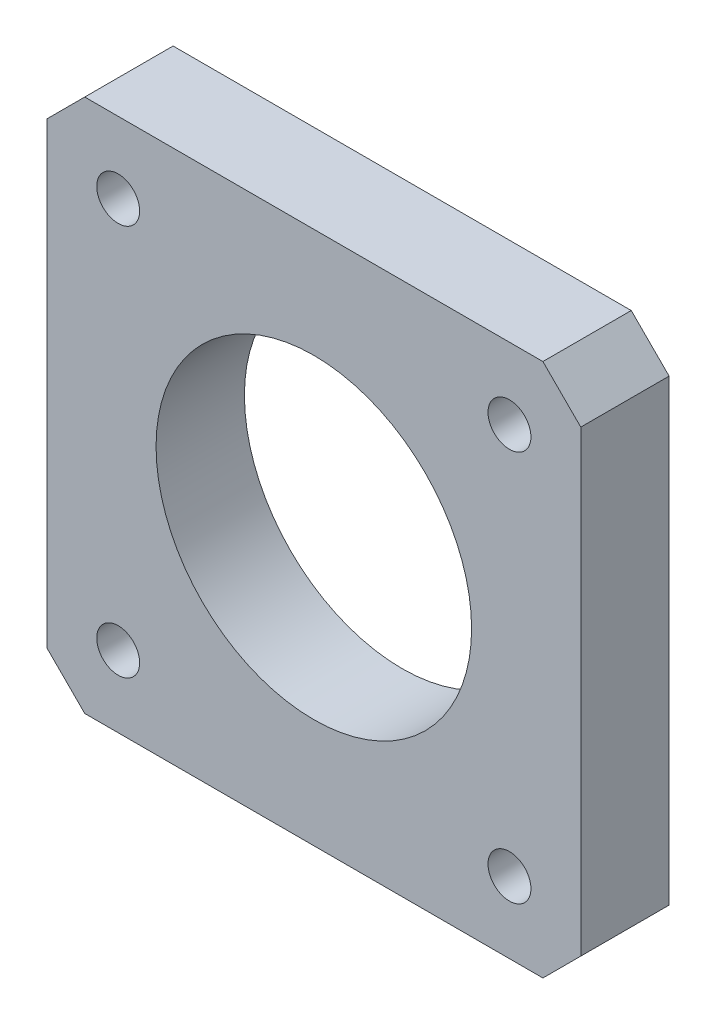
ISO-10303-21;
HEADER;
FILE_DESCRIPTION(('STEP AP214'),'2;1');
FILE_NAME('part.step','',(''),(''),'','','');
FILE_SCHEMA(('AUTOMOTIVE_DESIGN { 1 0 10303 214 1 1 1 1 }'));
ENDSEC;
DATA;
#1=APPLICATION_CONTEXT('core data for automotive mechanical design processes');
#2=APPLICATION_PROTOCOL_DEFINITION('international standard','automotive_design',2000,#1);
#3=PRODUCT_CONTEXT('',#1,'mechanical');
#4=PRODUCT('Part','Part','',(#3));
#5=PRODUCT_RELATED_PRODUCT_CATEGORY('part','',(#4));
#6=PRODUCT_DEFINITION_FORMATION('','',#4);
#7=PRODUCT_DEFINITION_CONTEXT('part definition',#1,'design');
#8=PRODUCT_DEFINITION('design','',#6,#7);
#9=PRODUCT_DEFINITION_SHAPE('','',#8);
#10=(LENGTH_UNIT() NAMED_UNIT(*) SI_UNIT(.MILLI.,.METRE.));
#11=(NAMED_UNIT(*) PLANE_ANGLE_UNIT() SI_UNIT($,.RADIAN.));
#12=(NAMED_UNIT(*) SI_UNIT($,.STERADIAN.) SOLID_ANGLE_UNIT());
#13=UNCERTAINTY_MEASURE_WITH_UNIT(LENGTH_MEASURE(1.E-05),#10,'distance_accuracy_value','');
#14=(GEOMETRIC_REPRESENTATION_CONTEXT(3) GLOBAL_UNCERTAINTY_ASSIGNED_CONTEXT((#13)) GLOBAL_UNIT_ASSIGNED_CONTEXT((#10,
#11,#12)) REPRESENTATION_CONTEXT('',''));
#15=CARTESIAN_POINT('',(0.,0.,0.));
#16=DIRECTION('',(0.,0.,1.));
#17=DIRECTION('',(1.,0.,0.));
#18=AXIS2_PLACEMENT_3D('',#15,#16,#17);
#19=CARTESIAN_POINT('',(0.,0.,7.));
#20=DIRECTION('',(0.,0.,-1.));
#21=DIRECTION('',(-1.,0.,0.));
#22=AXIS2_PLACEMENT_3D('',#19,#20,#21);
#23=PLANE('',#22);
#24=CARTESIAN_POINT('',(15.5,15.5,7.));
#25=DIRECTION('',(0.,0.,1.));
#26=DIRECTION('',(1.,0.,0.));
#27=AXIS2_PLACEMENT_3D('',#24,#25,#26);
#28=CIRCLE('',#27,1.7);
#29=CARTESIAN_POINT('',(17.2,15.5,7.));
#30=VERTEX_POINT('',#29);
#31=EDGE_CURVE('E247',#30,#30,#28,.T.);
#32=ORIENTED_EDGE('',*,*,#31,.F.);
#33=EDGE_LOOP('',(#32));
#34=FACE_BOUND('',#33,.T.);
#35=CARTESIAN_POINT('',(-15.5,15.4999999999998,7.));
#36=DIRECTION('',(0.,0.,1.));
#37=DIRECTION('',(1.,0.,0.));
#38=AXIS2_PLACEMENT_3D('',#35,#36,#37);
#39=CIRCLE('',#38,1.7);
#40=CARTESIAN_POINT('',(-13.8,15.4999999999998,7.));
#41=VERTEX_POINT('',#40);
#42=EDGE_CURVE('E172',#41,#41,#39,.T.);
#43=ORIENTED_EDGE('',*,*,#42,.F.);
#44=EDGE_LOOP('',(#43));
#45=FACE_BOUND('',#44,.T.);
#46=CARTESIAN_POINT('',(-15.4999999999997,-15.5000000000002,7.));
#47=DIRECTION('',(0.,0.,1.));
#48=DIRECTION('',(1.,0.,0.));
#49=AXIS2_PLACEMENT_3D('',#46,#47,#48);
#50=CIRCLE('',#49,1.7);
#51=CARTESIAN_POINT('',(-13.7999999999997,-15.5000000000002,7.));
#52=VERTEX_POINT('',#51);
#53=EDGE_CURVE('E161',#52,#52,#50,.T.);
#54=ORIENTED_EDGE('',*,*,#53,.F.);
#55=EDGE_LOOP('',(#54));
#56=FACE_BOUND('',#55,.T.);
#57=CARTESIAN_POINT('',(15.5000000000003,-15.5,7.));
#58=DIRECTION('',(0.,0.,1.));
#59=DIRECTION('',(1.,0.,0.));
#60=AXIS2_PLACEMENT_3D('',#57,#58,#59);
#61=CIRCLE('',#60,1.7);
#62=CARTESIAN_POINT('',(17.2000000000003,-15.5,7.));
#63=VERTEX_POINT('',#62);
#64=EDGE_CURVE('E160',#63,#63,#61,.T.);
#65=ORIENTED_EDGE('',*,*,#64,.F.);
#66=EDGE_LOOP('',(#65));
#67=FACE_BOUND('',#66,.T.);
#68=DIRECTION('',(0.,-1.,0.));
#69=VECTOR('',#68,1.);
#70=CARTESIAN_POINT('',(-21.15,-21.15,7.));
#71=LINE('',#70,#69);
#72=CARTESIAN_POINT('',(-21.15,18.15,7.));
#73=VERTEX_POINT('',#72);
#74=CARTESIAN_POINT('',(-21.15,-18.15,7.));
#75=VERTEX_POINT('',#74);
#76=EDGE_CURVE('E186',#73,#75,#71,.T.);
#77=ORIENTED_EDGE('',*,*,#76,.T.);
#78=DIRECTION('',(-0.707106781186547,0.707106781186548,0.));
#79=VECTOR('',#78,1.);
#80=CARTESIAN_POINT('',(-18.15,-21.15,7.));
#81=LINE('',#80,#79);
#82=CARTESIAN_POINT('',(-18.15,-21.15,7.));
#83=VERTEX_POINT('',#82);
#84=EDGE_CURVE('E150',#75,#83,#81,.F.);
#85=ORIENTED_EDGE('',*,*,#84,.T.);
#86=DIRECTION('',(1.,0.,0.));
#87=VECTOR('',#86,1.);
#88=CARTESIAN_POINT('',(-21.15,-21.15,7.));
#89=LINE('',#88,#87);
#90=CARTESIAN_POINT('',(18.15,-21.15,7.));
#91=VERTEX_POINT('',#90);
#92=EDGE_CURVE('E121',#83,#91,#89,.T.);
#93=ORIENTED_EDGE('',*,*,#92,.T.);
#94=DIRECTION('',(-0.707106781186549,-0.707106781186546,0.));
#95=VECTOR('',#94,1.);
#96=CARTESIAN_POINT('',(21.15,-18.15,7.));
#97=LINE('',#96,#95);
#98=CARTESIAN_POINT('',(21.15,-18.15,7.));
#99=VERTEX_POINT('',#98);
#100=EDGE_CURVE('E148',#91,#99,#97,.F.);
#101=ORIENTED_EDGE('',*,*,#100,.T.);
#102=DIRECTION('',(0.,1.,0.));
#103=VECTOR('',#102,1.);
#104=CARTESIAN_POINT('',(21.15,-21.15,7.));
#105=LINE('',#104,#103);
#106=CARTESIAN_POINT('',(21.15,18.15,7.));
#107=VERTEX_POINT('',#106);
#108=EDGE_CURVE('E128',#99,#107,#105,.T.);
#109=ORIENTED_EDGE('',*,*,#108,.T.);
#110=DIRECTION('',(0.707106781186546,-0.707106781186549,0.));
#111=VECTOR('',#110,1.);
#112=CARTESIAN_POINT('',(18.15,21.15,7.));
#113=LINE('',#112,#111);
#114=CARTESIAN_POINT('',(18.15,21.15,7.));
#115=VERTEX_POINT('',#114);
#116=EDGE_CURVE('E56',#107,#115,#113,.F.);
#117=ORIENTED_EDGE('',*,*,#116,.T.);
#118=DIRECTION('',(-1.,0.,0.));
#119=VECTOR('',#118,1.);
#120=CARTESIAN_POINT('',(-21.15,21.15,7.));
#121=LINE('',#120,#119);
#122=CARTESIAN_POINT('',(-18.15,21.15,7.));
#123=VERTEX_POINT('',#122);
#124=EDGE_CURVE('E131',#115,#123,#121,.T.);
#125=ORIENTED_EDGE('',*,*,#124,.T.);
#126=DIRECTION('',(0.707106781186548,0.707106781186547,0.));
#127=VECTOR('',#126,1.);
#128=CARTESIAN_POINT('',(-21.15,18.15,7.));
#129=LINE('',#128,#127);
#130=EDGE_CURVE('E146',#123,#73,#129,.F.);
#131=ORIENTED_EDGE('',*,*,#130,.T.);
#132=EDGE_LOOP('',(#77,#85,#93,#101,#109,#117,#125,#131));
#133=FACE_BOUND('',#132,.T.);
#134=CARTESIAN_POINT('',(0.,0.,7.));
#135=DIRECTION('',(0.,0.,1.));
#136=DIRECTION('',(1.,0.,0.));
#137=AXIS2_PLACEMENT_3D('',#134,#135,#136);
#138=CIRCLE('',#137,12.5);
#139=CARTESIAN_POINT('',(12.5,0.,7.));
#140=VERTEX_POINT('',#139);
#141=EDGE_CURVE('E179',#140,#140,#138,.T.);
#142=ORIENTED_EDGE('',*,*,#141,.F.);
#143=EDGE_LOOP('',(#142));
#144=FACE_BOUND('',#143,.T.);
#145=ADVANCED_FACE('F34',(#34,#45,#56,#67,#133,#144),#23,.F.);
#146=CARTESIAN_POINT('',(0.,0.,0.));
#147=DIRECTION('',(0.,0.,-1.));
#148=DIRECTION('',(-1.,0.,0.));
#149=AXIS2_PLACEMENT_3D('',#146,#147,#148);
#150=PLANE('',#149);
#151=CARTESIAN_POINT('',(15.5,15.5,0.));
#152=DIRECTION('',(0.,0.,-1.));
#153=DIRECTION('',(-1.,0.,0.));
#154=AXIS2_PLACEMENT_3D('',#151,#152,#153);
#155=CIRCLE('',#154,1.7);
#156=CARTESIAN_POINT('',(13.8,15.5,0.));
#157=VERTEX_POINT('',#156);
#158=EDGE_CURVE('E245',#157,#157,#155,.T.);
#159=ORIENTED_EDGE('',*,*,#158,.F.);
#160=EDGE_LOOP('',(#159));
#161=FACE_BOUND('',#160,.T.);
#162=CARTESIAN_POINT('',(-15.5,15.4999999999998,0.));
#163=DIRECTION('',(0.,0.,-1.));
#164=DIRECTION('',(-1.,0.,0.));
#165=AXIS2_PLACEMENT_3D('',#162,#163,#164);
#166=CIRCLE('',#165,1.7);
#167=CARTESIAN_POINT('',(-17.2,15.4999999999998,0.));
#168=VERTEX_POINT('',#167);
#169=EDGE_CURVE('E38',#168,#168,#166,.T.);
#170=ORIENTED_EDGE('',*,*,#169,.F.);
#171=EDGE_LOOP('',(#170));
#172=FACE_BOUND('',#171,.T.);
#173=CARTESIAN_POINT('',(-15.4999999999997,-15.5000000000002,0.));
#174=DIRECTION('',(0.,0.,-1.));
#175=DIRECTION('',(-1.,0.,0.));
#176=AXIS2_PLACEMENT_3D('',#173,#174,#175);
#177=CIRCLE('',#176,1.7);
#178=CARTESIAN_POINT('',(-17.1999999999997,-15.5000000000002,0.));
#179=VERTEX_POINT('',#178);
#180=EDGE_CURVE('E158',#179,#179,#177,.T.);
#181=ORIENTED_EDGE('',*,*,#180,.F.);
#182=EDGE_LOOP('',(#181));
#183=FACE_BOUND('',#182,.T.);
#184=CARTESIAN_POINT('',(15.5000000000003,-15.5,0.));
#185=DIRECTION('',(0.,0.,-1.));
#186=DIRECTION('',(-1.,0.,0.));
#187=AXIS2_PLACEMENT_3D('',#184,#185,#186);
#188=CIRCLE('',#187,1.7);
#189=CARTESIAN_POINT('',(13.8000000000003,-15.5,0.));
#190=VERTEX_POINT('',#189);
#191=EDGE_CURVE('E165',#190,#190,#188,.T.);
#192=ORIENTED_EDGE('',*,*,#191,.F.);
#193=EDGE_LOOP('',(#192));
#194=FACE_BOUND('',#193,.T.);
#195=DIRECTION('',(1.,0.,0.));
#196=VECTOR('',#195,1.);
#197=CARTESIAN_POINT('',(-21.15,-21.15,0.));
#198=LINE('',#197,#196);
#199=CARTESIAN_POINT('',(-18.15,-21.15,0.));
#200=VERTEX_POINT('',#199);
#201=CARTESIAN_POINT('',(18.15,-21.15,0.));
#202=VERTEX_POINT('',#201);
#203=EDGE_CURVE('E118',#200,#202,#198,.T.);
#204=ORIENTED_EDGE('',*,*,#203,.F.);
#205=DIRECTION('',(0.707106781186547,-0.707106781186548,0.));
#206=VECTOR('',#205,1.);
#207=CARTESIAN_POINT('',(-19.65,-19.65,0.));
#208=LINE('',#207,#206);
#209=CARTESIAN_POINT('',(-21.15,-18.15,0.));
#210=VERTEX_POINT('',#209);
#211=EDGE_CURVE('E101',#200,#210,#208,.F.);
#212=ORIENTED_EDGE('',*,*,#211,.T.);
#213=DIRECTION('',(0.,-1.,0.));
#214=VECTOR('',#213,1.);
#215=CARTESIAN_POINT('',(-21.15,-21.15,0.));
#216=LINE('',#215,#214);
#217=CARTESIAN_POINT('',(-21.15,18.15,0.));
#218=VERTEX_POINT('',#217);
#219=EDGE_CURVE('E129',#218,#210,#216,.T.);
#220=ORIENTED_EDGE('',*,*,#219,.F.);
#221=DIRECTION('',(-0.707106781186548,-0.707106781186547,0.));
#222=VECTOR('',#221,1.);
#223=CARTESIAN_POINT('',(-19.65,19.65,0.));
#224=LINE('',#223,#222);
#225=CARTESIAN_POINT('',(-18.15,21.15,0.));
#226=VERTEX_POINT('',#225);
#227=EDGE_CURVE('E139',#218,#226,#224,.F.);
#228=ORIENTED_EDGE('',*,*,#227,.T.);
#229=DIRECTION('',(-1.,0.,0.));
#230=VECTOR('',#229,1.);
#231=CARTESIAN_POINT('',(-21.15,21.15,0.));
#232=LINE('',#231,#230);
#233=CARTESIAN_POINT('',(18.15,21.15,0.));
#234=VERTEX_POINT('',#233);
#235=EDGE_CURVE('E133',#234,#226,#232,.T.);
#236=ORIENTED_EDGE('',*,*,#235,.F.);
#237=DIRECTION('',(-0.707106781186546,0.707106781186549,0.));
#238=VECTOR('',#237,1.);
#239=CARTESIAN_POINT('',(19.65,19.65,0.));
#240=LINE('',#239,#238);
#241=CARTESIAN_POINT('',(21.15,18.15,0.));
#242=VERTEX_POINT('',#241);
#243=EDGE_CURVE('E122',#234,#242,#240,.F.);
#244=ORIENTED_EDGE('',*,*,#243,.T.);
#245=DIRECTION('',(0.,1.,0.));
#246=VECTOR('',#245,1.);
#247=CARTESIAN_POINT('',(21.15,-21.15,0.));
#248=LINE('',#247,#246);
#249=CARTESIAN_POINT('',(21.15,-18.15,0.));
#250=VERTEX_POINT('',#249);
#251=EDGE_CURVE('E182',#250,#242,#248,.T.);
#252=ORIENTED_EDGE('',*,*,#251,.F.);
#253=DIRECTION('',(0.707106781186549,0.707106781186546,0.));
#254=VECTOR('',#253,1.);
#255=CARTESIAN_POINT('',(19.65,-19.65,0.));
#256=LINE('',#255,#254);
#257=EDGE_CURVE('E112',#250,#202,#256,.F.);
#258=ORIENTED_EDGE('',*,*,#257,.T.);
#259=EDGE_LOOP('',(#204,#212,#220,#228,#236,#244,#252,#258));
#260=FACE_BOUND('',#259,.T.);
#261=CARTESIAN_POINT('',(0.,0.,0.));
#262=DIRECTION('',(0.,0.,1.));
#263=DIRECTION('',(1.,0.,0.));
#264=AXIS2_PLACEMENT_3D('',#261,#262,#263);
#265=CIRCLE('',#264,12.5);
#266=CARTESIAN_POINT('',(12.5,0.,0.));
#267=VERTEX_POINT('',#266);
#268=EDGE_CURVE('E178',#267,#267,#265,.T.);
#269=ORIENTED_EDGE('',*,*,#268,.T.);
#270=EDGE_LOOP('',(#269));
#271=FACE_BOUND('',#270,.T.);
#272=ADVANCED_FACE('F125',(#161,#172,#183,#194,#260,#271),#150,.T.);
#273=CARTESIAN_POINT('',(21.15,-21.15,7.));
#274=DIRECTION('',(-1.,0.,0.));
#275=DIRECTION('',(0.,0.,1.));
#276=AXIS2_PLACEMENT_3D('',#273,#274,#275);
#277=PLANE('',#276);
#278=ORIENTED_EDGE('',*,*,#108,.F.);
#279=DIRECTION('',(0.,0.,-1.));
#280=VECTOR('',#279,1.);
#281=CARTESIAN_POINT('',(21.15,-18.15,7.));
#282=LINE('',#281,#280);
#283=EDGE_CURVE('E154',#99,#250,#282,.T.);
#284=ORIENTED_EDGE('',*,*,#283,.T.);
#285=ORIENTED_EDGE('',*,*,#251,.T.);
#286=DIRECTION('',(0.,0.,1.));
#287=VECTOR('',#286,1.);
#288=CARTESIAN_POINT('',(21.15,18.15,7.));
#289=LINE('',#288,#287);
#290=EDGE_CURVE('E152',#242,#107,#289,.T.);
#291=ORIENTED_EDGE('',*,*,#290,.T.);
#292=EDGE_LOOP('',(#278,#284,#285,#291));
#293=FACE_BOUND('',#292,.T.);
#294=ADVANCED_FACE('F210',(#293),#277,.F.);
#295=CARTESIAN_POINT('',(-21.15,21.15,7.));
#296=DIRECTION('',(0.,-1.,0.));
#297=DIRECTION('',(0.,0.,-1.));
#298=AXIS2_PLACEMENT_3D('',#295,#296,#297);
#299=PLANE('',#298);
#300=ORIENTED_EDGE('',*,*,#235,.T.);
#301=DIRECTION('',(0.,0.,1.));
#302=VECTOR('',#301,1.);
#303=CARTESIAN_POINT('',(-18.15,21.15,7.));
#304=LINE('',#303,#302);
#305=EDGE_CURVE('E11',#226,#123,#304,.T.);
#306=ORIENTED_EDGE('',*,*,#305,.T.);
#307=ORIENTED_EDGE('',*,*,#124,.F.);
#308=DIRECTION('',(0.,0.,-1.));
#309=VECTOR('',#308,1.);
#310=CARTESIAN_POINT('',(18.15,21.15,7.));
#311=LINE('',#310,#309);
#312=EDGE_CURVE('E43',#115,#234,#311,.T.);
#313=ORIENTED_EDGE('',*,*,#312,.T.);
#314=EDGE_LOOP('',(#300,#306,#307,#313));
#315=FACE_BOUND('',#314,.T.);
#316=ADVANCED_FACE('F192',(#315),#299,.F.);
#317=CARTESIAN_POINT('',(-21.15,-21.15,7.));
#318=DIRECTION('',(1.,0.,0.));
#319=DIRECTION('',(0.,0.,-1.));
#320=AXIS2_PLACEMENT_3D('',#317,#318,#319);
#321=PLANE('',#320);
#322=ORIENTED_EDGE('',*,*,#219,.T.);
#323=DIRECTION('',(0.,0.,1.));
#324=VECTOR('',#323,1.);
#325=CARTESIAN_POINT('',(-21.15,-18.15,7.));
#326=LINE('',#325,#324);
#327=EDGE_CURVE('E106',#210,#75,#326,.T.);
#328=ORIENTED_EDGE('',*,*,#327,.T.);
#329=ORIENTED_EDGE('',*,*,#76,.F.);
#330=DIRECTION('',(0.,0.,-1.));
#331=VECTOR('',#330,1.);
#332=CARTESIAN_POINT('',(-21.15,18.15,7.));
#333=LINE('',#332,#331);
#334=EDGE_CURVE('E111',#73,#218,#333,.T.);
#335=ORIENTED_EDGE('',*,*,#334,.T.);
#336=EDGE_LOOP('',(#322,#328,#329,#335));
#337=FACE_BOUND('',#336,.T.);
#338=ADVANCED_FACE('F201',(#337),#321,.F.);
#339=CARTESIAN_POINT('',(-21.15,-21.15,7.));
#340=DIRECTION('',(0.,1.,0.));
#341=DIRECTION('',(0.,0.,1.));
#342=AXIS2_PLACEMENT_3D('',#339,#340,#341);
#343=PLANE('',#342);
#344=ORIENTED_EDGE('',*,*,#92,.F.);
#345=DIRECTION('',(0.,0.,-1.));
#346=VECTOR('',#345,1.);
#347=CARTESIAN_POINT('',(-18.15,-21.15,7.));
#348=LINE('',#347,#346);
#349=EDGE_CURVE('E105',#83,#200,#348,.T.);
#350=ORIENTED_EDGE('',*,*,#349,.T.);
#351=ORIENTED_EDGE('',*,*,#203,.T.);
#352=DIRECTION('',(0.,0.,1.));
#353=VECTOR('',#352,1.);
#354=CARTESIAN_POINT('',(18.15,-21.15,7.));
#355=LINE('',#354,#353);
#356=EDGE_CURVE('E123',#202,#91,#355,.T.);
#357=ORIENTED_EDGE('',*,*,#356,.T.);
#358=EDGE_LOOP('',(#344,#350,#351,#357));
#359=FACE_BOUND('',#358,.T.);
#360=ADVANCED_FACE('F117',(#359),#343,.F.);
#361=CARTESIAN_POINT('',(0.,0.,7.));
#362=DIRECTION('',(0.,0.,-1.));
#363=DIRECTION('',(-1.,0.,0.));
#364=AXIS2_PLACEMENT_3D('',#361,#362,#363);
#365=CYLINDRICAL_SURFACE('',#364,12.5);
#366=ORIENTED_EDGE('',*,*,#141,.T.);
#367=EDGE_LOOP('',(#366));
#368=FACE_BOUND('',#367,.T.);
#369=ORIENTED_EDGE('',*,*,#268,.F.);
#370=EDGE_LOOP('',(#369));
#371=FACE_BOUND('',#370,.T.);
#372=ADVANCED_FACE('F208',(#368,#371),#365,.F.);
#373=CARTESIAN_POINT('',(-18.15,-21.15,7.));
#374=DIRECTION('',(0.707106781186548,0.707106781186547,0.));
#375=DIRECTION('',(0.,0.,-1.));
#376=AXIS2_PLACEMENT_3D('',#373,#374,#375);
#377=PLANE('',#376);
#378=ORIENTED_EDGE('',*,*,#84,.F.);
#379=ORIENTED_EDGE('',*,*,#327,.F.);
#380=ORIENTED_EDGE('',*,*,#211,.F.);
#381=ORIENTED_EDGE('',*,*,#349,.F.);
#382=EDGE_LOOP('',(#378,#379,#380,#381));
#383=FACE_BOUND('',#382,.T.);
#384=ADVANCED_FACE('F104',(#383),#377,.F.);
#385=CARTESIAN_POINT('',(21.15,-18.15,7.));
#386=DIRECTION('',(-0.707106781186546,0.707106781186549,0.));
#387=DIRECTION('',(0.,0.,-1.));
#388=AXIS2_PLACEMENT_3D('',#385,#386,#387);
#389=PLANE('',#388);
#390=ORIENTED_EDGE('',*,*,#100,.F.);
#391=ORIENTED_EDGE('',*,*,#356,.F.);
#392=ORIENTED_EDGE('',*,*,#257,.F.);
#393=ORIENTED_EDGE('',*,*,#283,.F.);
#394=EDGE_LOOP('',(#390,#391,#392,#393));
#395=FACE_BOUND('',#394,.T.);
#396=ADVANCED_FACE('F286',(#395),#389,.F.);
#397=CARTESIAN_POINT('',(-21.15,18.15,7.));
#398=DIRECTION('',(0.707106781186547,-0.707106781186548,0.));
#399=DIRECTION('',(0.,0.,-1.));
#400=AXIS2_PLACEMENT_3D('',#397,#398,#399);
#401=PLANE('',#400);
#402=ORIENTED_EDGE('',*,*,#130,.F.);
#403=ORIENTED_EDGE('',*,*,#305,.F.);
#404=ORIENTED_EDGE('',*,*,#227,.F.);
#405=ORIENTED_EDGE('',*,*,#334,.F.);
#406=EDGE_LOOP('',(#402,#403,#404,#405));
#407=FACE_BOUND('',#406,.T.);
#408=ADVANCED_FACE('F196',(#407),#401,.F.);
#409=CARTESIAN_POINT('',(18.15,21.15,7.));
#410=DIRECTION('',(-0.707106781186549,-0.707106781186546,0.));
#411=DIRECTION('',(0.,0.,-1.));
#412=AXIS2_PLACEMENT_3D('',#409,#410,#411);
#413=PLANE('',#412);
#414=ORIENTED_EDGE('',*,*,#116,.F.);
#415=ORIENTED_EDGE('',*,*,#290,.F.);
#416=ORIENTED_EDGE('',*,*,#243,.F.);
#417=ORIENTED_EDGE('',*,*,#312,.F.);
#418=EDGE_LOOP('',(#414,#415,#416,#417));
#419=FACE_BOUND('',#418,.T.);
#420=ADVANCED_FACE('F36',(#419),#413,.F.);
#421=CARTESIAN_POINT('',(15.5000000000003,-15.5,7.));
#422=DIRECTION('',(0.,0.,1.));
#423=DIRECTION('',(1.,0.,0.));
#424=AXIS2_PLACEMENT_3D('',#421,#422,#423);
#425=CYLINDRICAL_SURFACE('',#424,1.7);
#426=ORIENTED_EDGE('',*,*,#191,.T.);
#427=EDGE_LOOP('',(#426));
#428=FACE_BOUND('',#427,.T.);
#429=ORIENTED_EDGE('',*,*,#64,.T.);
#430=EDGE_LOOP('',(#429));
#431=FACE_BOUND('',#430,.T.);
#432=ADVANCED_FACE('F226',(#428,#431),#425,.F.);
#433=CARTESIAN_POINT('',(-15.4999999999997,-15.5000000000002,7.));
#434=DIRECTION('',(0.,0.,1.));
#435=DIRECTION('',(1.,0.,0.));
#436=AXIS2_PLACEMENT_3D('',#433,#434,#435);
#437=CYLINDRICAL_SURFACE('',#436,1.7);
#438=ORIENTED_EDGE('',*,*,#180,.T.);
#439=EDGE_LOOP('',(#438));
#440=FACE_BOUND('',#439,.T.);
#441=ORIENTED_EDGE('',*,*,#53,.T.);
#442=EDGE_LOOP('',(#441));
#443=FACE_BOUND('',#442,.T.);
#444=ADVANCED_FACE('F229',(#440,#443),#437,.F.);
#445=CARTESIAN_POINT('',(-15.5,15.4999999999998,7.));
#446=DIRECTION('',(0.,0.,1.));
#447=DIRECTION('',(1.,0.,0.));
#448=AXIS2_PLACEMENT_3D('',#445,#446,#447);
#449=CYLINDRICAL_SURFACE('',#448,1.7);
#450=ORIENTED_EDGE('',*,*,#169,.T.);
#451=EDGE_LOOP('',(#450));
#452=FACE_BOUND('',#451,.T.);
#453=ORIENTED_EDGE('',*,*,#42,.T.);
#454=EDGE_LOOP('',(#453));
#455=FACE_BOUND('',#454,.T.);
#456=ADVANCED_FACE('F233',(#452,#455),#449,.F.);
#457=CARTESIAN_POINT('',(15.5,15.5,7.));
#458=DIRECTION('',(0.,0.,1.));
#459=DIRECTION('',(1.,0.,0.));
#460=AXIS2_PLACEMENT_3D('',#457,#458,#459);
#461=CYLINDRICAL_SURFACE('',#460,1.7);
#462=ORIENTED_EDGE('',*,*,#158,.T.);
#463=EDGE_LOOP('',(#462));
#464=FACE_BOUND('',#463,.T.);
#465=ORIENTED_EDGE('',*,*,#31,.T.);
#466=EDGE_LOOP('',(#465));
#467=FACE_BOUND('',#466,.T.);
#468=ADVANCED_FACE('F236',(#464,#467),#461,.F.);
#469=CLOSED_SHELL('',(#145,#272,#294,#316,#338,#360,#372,#384,#396,#408,#420,#432,#444,#456,#468));
#470=MANIFOLD_SOLID_BREP('B2',#469);
#471=ADVANCED_BREP_SHAPE_REPRESENTATION('',(#18,#470),#14);
#472=SHAPE_DEFINITION_REPRESENTATION(#9,#471);
ENDSEC;
END-ISO-10303-21;
